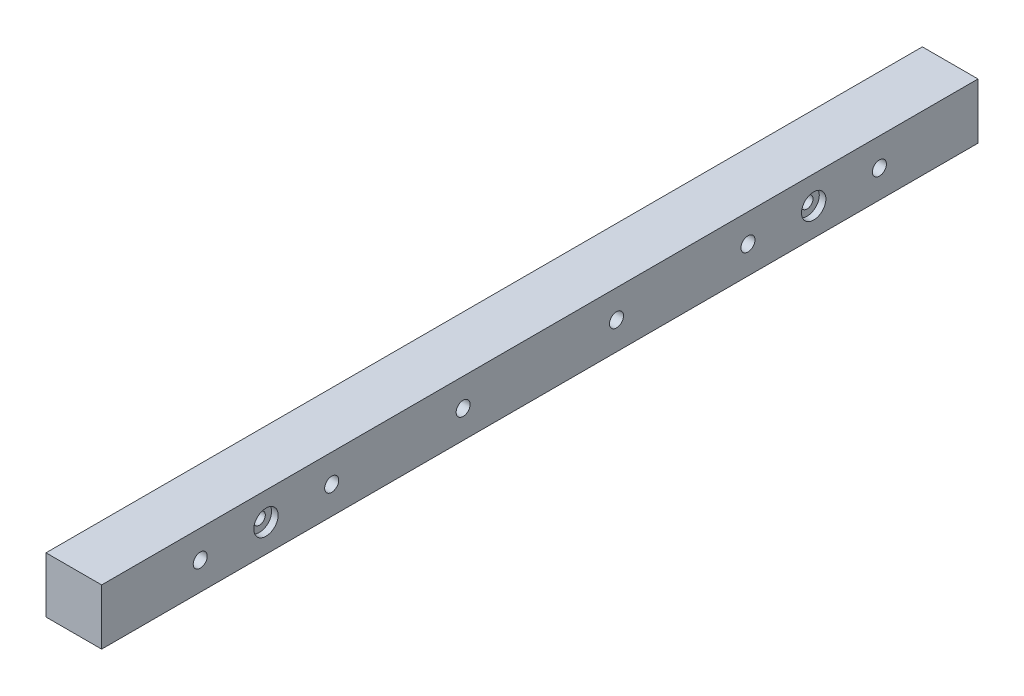
ISO-10303-21;
HEADER;
FILE_DESCRIPTION(('STEP AP214'),'2;1');
FILE_NAME('part.step','',(''),(''),'','','');
FILE_SCHEMA(('AUTOMOTIVE_DESIGN { 1 0 10303 214 1 1 1 1 }'));
ENDSEC;
DATA;
#1=APPLICATION_CONTEXT('core data for automotive mechanical design processes');
#2=APPLICATION_PROTOCOL_DEFINITION('international standard','automotive_design',2000,#1);
#3=PRODUCT_CONTEXT('',#1,'mechanical');
#4=PRODUCT('Part','Part','',(#3));
#5=PRODUCT_RELATED_PRODUCT_CATEGORY('part','',(#4));
#6=PRODUCT_DEFINITION_FORMATION('','',#4);
#7=PRODUCT_DEFINITION_CONTEXT('part definition',#1,'design');
#8=PRODUCT_DEFINITION('design','',#6,#7);
#9=PRODUCT_DEFINITION_SHAPE('','',#8);
#10=(LENGTH_UNIT() NAMED_UNIT(*) SI_UNIT(.MILLI.,.METRE.));
#11=(NAMED_UNIT(*) PLANE_ANGLE_UNIT() SI_UNIT($,.RADIAN.));
#12=(NAMED_UNIT(*) SI_UNIT($,.STERADIAN.) SOLID_ANGLE_UNIT());
#13=UNCERTAINTY_MEASURE_WITH_UNIT(LENGTH_MEASURE(1.E-05),#10,'distance_accuracy_value','');
#14=(GEOMETRIC_REPRESENTATION_CONTEXT(3) GLOBAL_UNCERTAINTY_ASSIGNED_CONTEXT((#13)) GLOBAL_UNIT_ASSIGNED_CONTEXT((#10,
#11,#12)) REPRESENTATION_CONTEXT('',''));
#15=CARTESIAN_POINT('',(0.,0.,0.));
#16=DIRECTION('',(0.,0.,1.));
#17=DIRECTION('',(1.,0.,0.));
#18=AXIS2_PLACEMENT_3D('',#15,#16,#17);
#19=CARTESIAN_POINT('',(12.7,-12.7,-200.));
#20=DIRECTION('',(1.,0.,0.));
#21=DIRECTION('',(0.,1.,0.));
#22=AXIS2_PLACEMENT_3D('',#19,#20,#21);
#23=PLANE('',#22);
#24=CARTESIAN_POINT('',(12.7,0.,-125.));
#25=DIRECTION('',(1.,0.,0.));
#26=DIRECTION('',(0.,0.,-1.));
#27=AXIS2_PLACEMENT_3D('',#24,#25,#26);
#28=CIRCLE('',#27,5.55625);
#29=CARTESIAN_POINT('',(12.7,0.,-130.55625));
#30=VERTEX_POINT('',#29);
#31=EDGE_CURVE('E195',#30,#30,#28,.T.);
#32=ORIENTED_EDGE('',*,*,#31,.F.);
#33=EDGE_LOOP('',(#32));
#34=FACE_BOUND('',#33,.T.);
#35=CARTESIAN_POINT('',(12.7,0.,-155.));
#36=DIRECTION('',(1.,0.,0.));
#37=DIRECTION('',(0.,1.,0.));
#38=AXIS2_PLACEMENT_3D('',#35,#36,#37);
#39=CIRCLE('',#38,3.20000000000001);
#40=CARTESIAN_POINT('',(12.7,3.19999999999998,-155.));
#41=VERTEX_POINT('',#40);
#42=EDGE_CURVE('E112',#41,#41,#39,.T.);
#43=ORIENTED_EDGE('',*,*,#42,.F.);
#44=EDGE_LOOP('',(#43));
#45=FACE_BOUND('',#44,.T.);
#46=CARTESIAN_POINT('',(12.7,0.,-95.));
#47=DIRECTION('',(1.,0.,0.));
#48=DIRECTION('',(0.,1.,0.));
#49=AXIS2_PLACEMENT_3D('',#46,#47,#48);
#50=CIRCLE('',#49,3.20000000000001);
#51=CARTESIAN_POINT('',(12.7,3.19999999999998,-95.));
#52=VERTEX_POINT('',#51);
#53=EDGE_CURVE('E163',#52,#52,#50,.T.);
#54=ORIENTED_EDGE('',*,*,#53,.F.);
#55=EDGE_LOOP('',(#54));
#56=FACE_BOUND('',#55,.T.);
#57=CARTESIAN_POINT('',(12.7,0.,-35.));
#58=DIRECTION('',(1.,0.,0.));
#59=DIRECTION('',(0.,1.,0.));
#60=AXIS2_PLACEMENT_3D('',#57,#58,#59);
#61=CIRCLE('',#60,3.20000000000001);
#62=CARTESIAN_POINT('',(12.7,3.19999999999998,-35.));
#63=VERTEX_POINT('',#62);
#64=EDGE_CURVE('E166',#63,#63,#61,.T.);
#65=ORIENTED_EDGE('',*,*,#64,.F.);
#66=EDGE_LOOP('',(#65));
#67=FACE_BOUND('',#66,.T.);
#68=CARTESIAN_POINT('',(12.7,0.,35.));
#69=DIRECTION('',(1.,0.,0.));
#70=DIRECTION('',(0.,1.,0.));
#71=AXIS2_PLACEMENT_3D('',#68,#69,#70);
#72=CIRCLE('',#71,3.20000000000001);
#73=CARTESIAN_POINT('',(12.7,3.19999999999998,35.));
#74=VERTEX_POINT('',#73);
#75=EDGE_CURVE('E169',#74,#74,#72,.T.);
#76=ORIENTED_EDGE('',*,*,#75,.F.);
#77=EDGE_LOOP('',(#76));
#78=FACE_BOUND('',#77,.T.);
#79=CARTESIAN_POINT('',(12.7,0.,95.));
#80=DIRECTION('',(1.,0.,0.));
#81=DIRECTION('',(0.,1.,0.));
#82=AXIS2_PLACEMENT_3D('',#79,#80,#81);
#83=CIRCLE('',#82,3.20000000000001);
#84=CARTESIAN_POINT('',(12.7,3.19999999999998,95.));
#85=VERTEX_POINT('',#84);
#86=EDGE_CURVE('E95',#85,#85,#83,.T.);
#87=ORIENTED_EDGE('',*,*,#86,.F.);
#88=EDGE_LOOP('',(#87));
#89=FACE_BOUND('',#88,.T.);
#90=CARTESIAN_POINT('',(12.7,0.,155.));
#91=DIRECTION('',(1.,0.,0.));
#92=DIRECTION('',(0.,1.,0.));
#93=AXIS2_PLACEMENT_3D('',#90,#91,#92);
#94=CIRCLE('',#93,3.20000000000001);
#95=CARTESIAN_POINT('',(12.7,3.19999999999998,155.));
#96=VERTEX_POINT('',#95);
#97=EDGE_CURVE('E92',#96,#96,#94,.T.);
#98=ORIENTED_EDGE('',*,*,#97,.F.);
#99=EDGE_LOOP('',(#98));
#100=FACE_BOUND('',#99,.T.);
#101=DIRECTION('',(0.,0.,1.));
#102=VECTOR('',#101,1.);
#103=CARTESIAN_POINT('',(12.7,12.7,-200.));
#104=LINE('',#103,#102);
#105=CARTESIAN_POINT('',(12.7,12.7,-200.));
#106=VERTEX_POINT('',#105);
#107=CARTESIAN_POINT('',(12.7,12.7,200.));
#108=VERTEX_POINT('',#107);
#109=EDGE_CURVE('E69',#106,#108,#104,.T.);
#110=ORIENTED_EDGE('',*,*,#109,.T.);
#111=DIRECTION('',(0.,1.,0.));
#112=VECTOR('',#111,1.);
#113=CARTESIAN_POINT('',(12.7,-12.7,200.));
#114=LINE('',#113,#112);
#115=CARTESIAN_POINT('',(12.7,-12.7,200.));
#116=VERTEX_POINT('',#115);
#117=EDGE_CURVE('E73',#116,#108,#114,.T.);
#118=ORIENTED_EDGE('',*,*,#117,.F.);
#119=DIRECTION('',(0.,0.,1.));
#120=VECTOR('',#119,1.);
#121=CARTESIAN_POINT('',(12.7,-12.7,-200.));
#122=LINE('',#121,#120);
#123=CARTESIAN_POINT('',(12.7,-12.7,-200.));
#124=VERTEX_POINT('',#123);
#125=EDGE_CURVE('E11',#124,#116,#122,.T.);
#126=ORIENTED_EDGE('',*,*,#125,.F.);
#127=DIRECTION('',(0.,1.,0.));
#128=VECTOR('',#127,1.);
#129=CARTESIAN_POINT('',(12.7,-12.7,-200.));
#130=LINE('',#129,#128);
#131=EDGE_CURVE('E74',#124,#106,#130,.T.);
#132=ORIENTED_EDGE('',*,*,#131,.T.);
#133=EDGE_LOOP('',(#110,#118,#126,#132));
#134=FACE_BOUND('',#133,.T.);
#135=CARTESIAN_POINT('',(12.7,0.,125.));
#136=DIRECTION('',(-1.,0.,0.));
#137=DIRECTION('',(0.,0.,1.));
#138=AXIS2_PLACEMENT_3D('',#135,#136,#137);
#139=CIRCLE('',#138,5.55625);
#140=CARTESIAN_POINT('',(12.7,0.,130.55625));
#141=VERTEX_POINT('',#140);
#142=EDGE_CURVE('E214',#141,#141,#139,.T.);
#143=ORIENTED_EDGE('',*,*,#142,.T.);
#144=EDGE_LOOP('',(#143));
#145=FACE_BOUND('',#144,.T.);
#146=ADVANCED_FACE('F31',(#34,#45,#56,#67,#78,#89,#100,#134,#145),#23,.T.);
#147=CARTESIAN_POINT('',(-12.7,-12.7,-200.));
#148=DIRECTION('',(-1.,0.,0.));
#149=DIRECTION('',(0.,-1.,0.));
#150=AXIS2_PLACEMENT_3D('',#147,#148,#149);
#151=PLANE('',#150);
#152=CARTESIAN_POINT('',(-12.7,0.,-125.));
#153=DIRECTION('',(1.,0.,0.));
#154=DIRECTION('',(0.,0.,-1.));
#155=AXIS2_PLACEMENT_3D('',#152,#153,#154);
#156=CIRCLE('',#155,6.00000000000001);
#157=CARTESIAN_POINT('',(-12.7,0.,-131.));
#158=VERTEX_POINT('',#157);
#159=EDGE_CURVE('E211',#158,#158,#156,.T.);
#160=ORIENTED_EDGE('',*,*,#159,.T.);
#161=EDGE_LOOP('',(#160));
#162=FACE_BOUND('',#161,.T.);
#163=CARTESIAN_POINT('',(-12.7,0.,155.));
#164=DIRECTION('',(-1.,0.,0.));
#165=DIRECTION('',(0.,-1.,0.));
#166=AXIS2_PLACEMENT_3D('',#163,#164,#165);
#167=CIRCLE('',#166,3.99999999999999);
#168=CARTESIAN_POINT('',(-12.7,-4.00000000000002,155.));
#169=VERTEX_POINT('',#168);
#170=EDGE_CURVE('E144',#169,#169,#167,.T.);
#171=ORIENTED_EDGE('',*,*,#170,.F.);
#172=EDGE_LOOP('',(#171));
#173=FACE_BOUND('',#172,.T.);
#174=CARTESIAN_POINT('',(-12.7,0.,95.));
#175=DIRECTION('',(-1.,0.,0.));
#176=DIRECTION('',(0.,-1.,0.));
#177=AXIS2_PLACEMENT_3D('',#174,#175,#176);
#178=CIRCLE('',#177,4.00000000000001);
#179=CARTESIAN_POINT('',(-12.7,-4.00000000000003,95.));
#180=VERTEX_POINT('',#179);
#181=EDGE_CURVE('E137',#180,#180,#178,.T.);
#182=ORIENTED_EDGE('',*,*,#181,.F.);
#183=EDGE_LOOP('',(#182));
#184=FACE_BOUND('',#183,.T.);
#185=CARTESIAN_POINT('',(-12.7,0.,35.));
#186=DIRECTION('',(-1.,0.,0.));
#187=DIRECTION('',(0.,-1.,0.));
#188=AXIS2_PLACEMENT_3D('',#185,#186,#187);
#189=CIRCLE('',#188,4.00000000000001);
#190=CARTESIAN_POINT('',(-12.7,-4.00000000000003,35.));
#191=VERTEX_POINT('',#190);
#192=EDGE_CURVE('E130',#191,#191,#189,.T.);
#193=ORIENTED_EDGE('',*,*,#192,.F.);
#194=EDGE_LOOP('',(#193));
#195=FACE_BOUND('',#194,.T.);
#196=CARTESIAN_POINT('',(-12.7,0.,-35.));
#197=DIRECTION('',(-1.,0.,0.));
#198=DIRECTION('',(0.,-1.,0.));
#199=AXIS2_PLACEMENT_3D('',#196,#197,#198);
#200=CIRCLE('',#199,4.);
#201=CARTESIAN_POINT('',(-12.7,-4.00000000000003,-35.));
#202=VERTEX_POINT('',#201);
#203=EDGE_CURVE('E126',#202,#202,#200,.T.);
#204=ORIENTED_EDGE('',*,*,#203,.F.);
#205=EDGE_LOOP('',(#204));
#206=FACE_BOUND('',#205,.T.);
#207=CARTESIAN_POINT('',(-12.7,0.,-95.));
#208=DIRECTION('',(-1.,0.,0.));
#209=DIRECTION('',(0.,-1.,0.));
#210=AXIS2_PLACEMENT_3D('',#207,#208,#209);
#211=CIRCLE('',#210,4.00000000000001);
#212=CARTESIAN_POINT('',(-12.7,-4.00000000000003,-95.));
#213=VERTEX_POINT('',#212);
#214=EDGE_CURVE('E122',#213,#213,#211,.T.);
#215=ORIENTED_EDGE('',*,*,#214,.F.);
#216=EDGE_LOOP('',(#215));
#217=FACE_BOUND('',#216,.T.);
#218=CARTESIAN_POINT('',(-12.7,0.,-155.));
#219=DIRECTION('',(-1.,0.,0.));
#220=DIRECTION('',(0.,-1.,0.));
#221=AXIS2_PLACEMENT_3D('',#218,#219,#220);
#222=CIRCLE('',#221,3.99999999999999);
#223=CARTESIAN_POINT('',(-12.7,-4.00000000000002,-155.));
#224=VERTEX_POINT('',#223);
#225=EDGE_CURVE('E117',#224,#224,#222,.T.);
#226=ORIENTED_EDGE('',*,*,#225,.F.);
#227=EDGE_LOOP('',(#226));
#228=FACE_BOUND('',#227,.T.);
#229=DIRECTION('',(0.,0.,1.));
#230=VECTOR('',#229,1.);
#231=CARTESIAN_POINT('',(-12.7,-12.7,-200.));
#232=LINE('',#231,#230);
#233=CARTESIAN_POINT('',(-12.7,-12.7,-200.));
#234=VERTEX_POINT('',#233);
#235=CARTESIAN_POINT('',(-12.7,-12.7,200.));
#236=VERTEX_POINT('',#235);
#237=EDGE_CURVE('E39',#234,#236,#232,.T.);
#238=ORIENTED_EDGE('',*,*,#237,.T.);
#239=DIRECTION('',(0.,-1.,0.));
#240=VECTOR('',#239,1.);
#241=CARTESIAN_POINT('',(-12.7,-12.7,200.));
#242=LINE('',#241,#240);
#243=CARTESIAN_POINT('',(-12.7,12.7,200.));
#244=VERTEX_POINT('',#243);
#245=EDGE_CURVE('E87',#244,#236,#242,.T.);
#246=ORIENTED_EDGE('',*,*,#245,.F.);
#247=DIRECTION('',(0.,0.,1.));
#248=VECTOR('',#247,1.);
#249=CARTESIAN_POINT('',(-12.7,12.7,-200.));
#250=LINE('',#249,#248);
#251=CARTESIAN_POINT('',(-12.7,12.7,-200.));
#252=VERTEX_POINT('',#251);
#253=EDGE_CURVE('E78',#252,#244,#250,.T.);
#254=ORIENTED_EDGE('',*,*,#253,.F.);
#255=DIRECTION('',(0.,-1.,0.));
#256=VECTOR('',#255,1.);
#257=CARTESIAN_POINT('',(-12.7,-12.7,-200.));
#258=LINE('',#257,#256);
#259=EDGE_CURVE('E104',#252,#234,#258,.T.);
#260=ORIENTED_EDGE('',*,*,#259,.T.);
#261=EDGE_LOOP('',(#238,#246,#254,#260));
#262=FACE_BOUND('',#261,.T.);
#263=CARTESIAN_POINT('',(-12.7,0.,125.));
#264=DIRECTION('',(-1.,0.,0.));
#265=DIRECTION('',(0.,0.,1.));
#266=AXIS2_PLACEMENT_3D('',#263,#264,#265);
#267=CIRCLE('',#266,6.00000000000001);
#268=CARTESIAN_POINT('',(-12.7,0.,131.));
#269=VERTEX_POINT('',#268);
#270=EDGE_CURVE('E229',#269,#269,#267,.T.);
#271=ORIENTED_EDGE('',*,*,#270,.F.);
#272=EDGE_LOOP('',(#271));
#273=FACE_BOUND('',#272,.T.);
#274=ADVANCED_FACE('F179',(#162,#173,#184,#195,#206,#217,#228,#262,#273),#151,.T.);
#275=CARTESIAN_POINT('',(-12.7,0.,155.));
#276=DIRECTION('',(1.,0.,0.));
#277=DIRECTION('',(0.,1.,0.));
#278=AXIS2_PLACEMENT_3D('',#275,#276,#277);
#279=CYLINDRICAL_SURFACE('',#278,3.20000000000001);
#280=ORIENTED_EDGE('',*,*,#97,.T.);
#281=EDGE_LOOP('',(#280));
#282=FACE_BOUND('',#281,.T.);
#283=CARTESIAN_POINT('',(-9.7,0.,155.));
#284=DIRECTION('',(-1.,0.,0.));
#285=DIRECTION('',(0.,-1.,0.));
#286=AXIS2_PLACEMENT_3D('',#283,#284,#285);
#287=CIRCLE('',#286,3.20000000000001);
#288=CARTESIAN_POINT('',(-9.7,-3.20000000000004,155.));
#289=VERTEX_POINT('',#288);
#290=EDGE_CURVE('E34',#289,#289,#287,.F.);
#291=ORIENTED_EDGE('',*,*,#290,.F.);
#292=EDGE_LOOP('',(#291));
#293=FACE_BOUND('',#292,.T.);
#294=ADVANCED_FACE('F183',(#282,#293),#279,.F.);
#295=CARTESIAN_POINT('',(-12.7,0.,95.));
#296=DIRECTION('',(1.,0.,0.));
#297=DIRECTION('',(0.,1.,0.));
#298=AXIS2_PLACEMENT_3D('',#295,#296,#297);
#299=CYLINDRICAL_SURFACE('',#298,3.20000000000001);
#300=ORIENTED_EDGE('',*,*,#86,.T.);
#301=EDGE_LOOP('',(#300));
#302=FACE_BOUND('',#301,.T.);
#303=CARTESIAN_POINT('',(-9.7,0.,95.));
#304=DIRECTION('',(-1.,0.,0.));
#305=DIRECTION('',(0.,-1.,0.));
#306=AXIS2_PLACEMENT_3D('',#303,#304,#305);
#307=CIRCLE('',#306,3.20000000000001);
#308=CARTESIAN_POINT('',(-9.7,-3.20000000000004,95.));
#309=VERTEX_POINT('',#308);
#310=EDGE_CURVE('E128',#309,#309,#307,.F.);
#311=ORIENTED_EDGE('',*,*,#310,.F.);
#312=EDGE_LOOP('',(#311));
#313=FACE_BOUND('',#312,.T.);
#314=ADVANCED_FACE('F174',(#302,#313),#299,.F.);
#315=CARTESIAN_POINT('',(-12.7,0.,35.));
#316=DIRECTION('',(1.,0.,0.));
#317=DIRECTION('',(0.,1.,0.));
#318=AXIS2_PLACEMENT_3D('',#315,#316,#317);
#319=CYLINDRICAL_SURFACE('',#318,3.20000000000001);
#320=ORIENTED_EDGE('',*,*,#75,.T.);
#321=EDGE_LOOP('',(#320));
#322=FACE_BOUND('',#321,.T.);
#323=CARTESIAN_POINT('',(-9.7,0.,35.));
#324=DIRECTION('',(-1.,0.,0.));
#325=DIRECTION('',(0.,-1.,0.));
#326=AXIS2_PLACEMENT_3D('',#323,#324,#325);
#327=CIRCLE('',#326,3.20000000000001);
#328=CARTESIAN_POINT('',(-9.7,-3.20000000000004,35.));
#329=VERTEX_POINT('',#328);
#330=EDGE_CURVE('E124',#329,#329,#327,.F.);
#331=ORIENTED_EDGE('',*,*,#330,.F.);
#332=EDGE_LOOP('',(#331));
#333=FACE_BOUND('',#332,.T.);
#334=ADVANCED_FACE('F274',(#322,#333),#319,.F.);
#335=CARTESIAN_POINT('',(-12.7,0.,-35.));
#336=DIRECTION('',(1.,0.,0.));
#337=DIRECTION('',(0.,1.,0.));
#338=AXIS2_PLACEMENT_3D('',#335,#336,#337);
#339=CYLINDRICAL_SURFACE('',#338,3.20000000000001);
#340=ORIENTED_EDGE('',*,*,#64,.T.);
#341=EDGE_LOOP('',(#340));
#342=FACE_BOUND('',#341,.T.);
#343=CARTESIAN_POINT('',(-9.7,0.,-35.));
#344=DIRECTION('',(-1.,0.,0.));
#345=DIRECTION('',(0.,-1.,0.));
#346=AXIS2_PLACEMENT_3D('',#343,#344,#345);
#347=CIRCLE('',#346,3.20000000000001);
#348=CARTESIAN_POINT('',(-9.7,-3.20000000000004,-35.));
#349=VERTEX_POINT('',#348);
#350=EDGE_CURVE('E119',#349,#349,#347,.F.);
#351=ORIENTED_EDGE('',*,*,#350,.F.);
#352=EDGE_LOOP('',(#351));
#353=FACE_BOUND('',#352,.T.);
#354=ADVANCED_FACE('F264',(#342,#353),#339,.F.);
#355=CARTESIAN_POINT('',(-12.7,0.,-95.));
#356=DIRECTION('',(1.,0.,0.));
#357=DIRECTION('',(0.,1.,0.));
#358=AXIS2_PLACEMENT_3D('',#355,#356,#357);
#359=CYLINDRICAL_SURFACE('',#358,3.20000000000001);
#360=ORIENTED_EDGE('',*,*,#53,.T.);
#361=EDGE_LOOP('',(#360));
#362=FACE_BOUND('',#361,.T.);
#363=CARTESIAN_POINT('',(-9.7,0.,-95.));
#364=DIRECTION('',(-1.,0.,0.));
#365=DIRECTION('',(0.,-1.,0.));
#366=AXIS2_PLACEMENT_3D('',#363,#364,#365);
#367=CIRCLE('',#366,3.20000000000001);
#368=CARTESIAN_POINT('',(-9.7,-3.20000000000004,-95.));
#369=VERTEX_POINT('',#368);
#370=EDGE_CURVE('E114',#369,#369,#367,.F.);
#371=ORIENTED_EDGE('',*,*,#370,.F.);
#372=EDGE_LOOP('',(#371));
#373=FACE_BOUND('',#372,.T.);
#374=ADVANCED_FACE('F255',(#362,#373),#359,.F.);
#375=CARTESIAN_POINT('',(-12.7,0.,-155.));
#376=DIRECTION('',(1.,0.,0.));
#377=DIRECTION('',(0.,1.,0.));
#378=AXIS2_PLACEMENT_3D('',#375,#376,#377);
#379=CYLINDRICAL_SURFACE('',#378,3.20000000000001);
#380=ORIENTED_EDGE('',*,*,#42,.T.);
#381=EDGE_LOOP('',(#380));
#382=FACE_BOUND('',#381,.T.);
#383=CARTESIAN_POINT('',(-9.7,0.,-155.));
#384=DIRECTION('',(-1.,0.,0.));
#385=DIRECTION('',(0.,-1.,0.));
#386=AXIS2_PLACEMENT_3D('',#383,#384,#385);
#387=CIRCLE('',#386,3.20000000000001);
#388=CARTESIAN_POINT('',(-9.7,-3.20000000000004,-155.));
#389=VERTEX_POINT('',#388);
#390=EDGE_CURVE('E109',#389,#389,#387,.F.);
#391=ORIENTED_EDGE('',*,*,#390,.F.);
#392=EDGE_LOOP('',(#391));
#393=FACE_BOUND('',#392,.T.);
#394=ADVANCED_FACE('F251',(#382,#393),#379,.F.);
#395=CARTESIAN_POINT('',(12.7,-12.7,-200.));
#396=DIRECTION('',(0.,-1.,0.));
#397=DIRECTION('',(0.,0.,-1.));
#398=AXIS2_PLACEMENT_3D('',#395,#396,#397);
#399=PLANE('',#398);
#400=ORIENTED_EDGE('',*,*,#125,.T.);
#401=DIRECTION('',(1.,0.,0.));
#402=VECTOR('',#401,1.);
#403=CARTESIAN_POINT('',(12.7,-12.7,200.));
#404=LINE('',#403,#402);
#405=EDGE_CURVE('E91',#236,#116,#404,.T.);
#406=ORIENTED_EDGE('',*,*,#405,.F.);
#407=ORIENTED_EDGE('',*,*,#237,.F.);
#408=DIRECTION('',(1.,0.,0.));
#409=VECTOR('',#408,1.);
#410=CARTESIAN_POINT('',(12.7,-12.7,-200.));
#411=LINE('',#410,#409);
#412=EDGE_CURVE('E79',#234,#124,#411,.T.);
#413=ORIENTED_EDGE('',*,*,#412,.T.);
#414=EDGE_LOOP('',(#400,#406,#407,#413));
#415=FACE_BOUND('',#414,.T.);
#416=ADVANCED_FACE('F242',(#415),#399,.T.);
#417=CARTESIAN_POINT('',(12.7,12.7,-200.));
#418=DIRECTION('',(0.,1.,0.));
#419=DIRECTION('',(0.,0.,1.));
#420=AXIS2_PLACEMENT_3D('',#417,#418,#419);
#421=PLANE('',#420);
#422=ORIENTED_EDGE('',*,*,#253,.T.);
#423=DIRECTION('',(-1.,0.,0.));
#424=VECTOR('',#423,1.);
#425=CARTESIAN_POINT('',(12.7,12.7,200.));
#426=LINE('',#425,#424);
#427=EDGE_CURVE('E82',#108,#244,#426,.T.);
#428=ORIENTED_EDGE('',*,*,#427,.F.);
#429=ORIENTED_EDGE('',*,*,#109,.F.);
#430=DIRECTION('',(-1.,0.,0.));
#431=VECTOR('',#430,1.);
#432=CARTESIAN_POINT('',(12.7,12.7,-200.));
#433=LINE('',#432,#431);
#434=EDGE_CURVE('E102',#106,#252,#433,.T.);
#435=ORIENTED_EDGE('',*,*,#434,.T.);
#436=EDGE_LOOP('',(#422,#428,#429,#435));
#437=FACE_BOUND('',#436,.T.);
#438=ADVANCED_FACE('F83',(#437),#421,.T.);
#439=CARTESIAN_POINT('',(12.7,12.7,-200.));
#440=DIRECTION('',(0.,0.,1.));
#441=DIRECTION('',(1.,0.,0.));
#442=AXIS2_PLACEMENT_3D('',#439,#440,#441);
#443=PLANE('',#442);
#444=ORIENTED_EDGE('',*,*,#131,.F.);
#445=ORIENTED_EDGE('',*,*,#412,.F.);
#446=ORIENTED_EDGE('',*,*,#259,.F.);
#447=ORIENTED_EDGE('',*,*,#434,.F.);
#448=EDGE_LOOP('',(#444,#445,#446,#447));
#449=FACE_BOUND('',#448,.T.);
#450=ADVANCED_FACE('F245',(#449),#443,.F.);
#451=CARTESIAN_POINT('',(12.7,12.7,200.));
#452=DIRECTION('',(0.,0.,1.));
#453=DIRECTION('',(1.,0.,0.));
#454=AXIS2_PLACEMENT_3D('',#451,#452,#453);
#455=PLANE('',#454);
#456=ORIENTED_EDGE('',*,*,#117,.T.);
#457=ORIENTED_EDGE('',*,*,#427,.T.);
#458=ORIENTED_EDGE('',*,*,#245,.T.);
#459=ORIENTED_EDGE('',*,*,#405,.T.);
#460=EDGE_LOOP('',(#456,#457,#458,#459));
#461=FACE_BOUND('',#460,.T.);
#462=ADVANCED_FACE('F90',(#461),#455,.T.);
#463=CARTESIAN_POINT('',(-9.7,0.,-155.));
#464=DIRECTION('',(-1.,0.,0.));
#465=DIRECTION('',(0.,-1.,0.));
#466=AXIS2_PLACEMENT_3D('',#463,#464,#465);
#467=PLANE('',#466);
#468=CARTESIAN_POINT('',(-9.7,0.,-155.));
#469=DIRECTION('',(-1.,0.,0.));
#470=DIRECTION('',(0.,-1.,0.));
#471=AXIS2_PLACEMENT_3D('',#468,#469,#470);
#472=CIRCLE('',#471,3.99999999999999);
#473=CARTESIAN_POINT('',(-9.7,-4.00000000000002,-155.));
#474=VERTEX_POINT('',#473);
#475=EDGE_CURVE('E113',#474,#474,#472,.T.);
#476=ORIENTED_EDGE('',*,*,#475,.T.);
#477=EDGE_LOOP('',(#476));
#478=FACE_BOUND('',#477,.T.);
#479=ORIENTED_EDGE('',*,*,#390,.T.);
#480=EDGE_LOOP('',(#479));
#481=FACE_BOUND('',#480,.T.);
#482=ADVANCED_FACE('F282',(#478,#481),#467,.T.);
#483=CARTESIAN_POINT('',(-9.7,0.,-155.));
#484=DIRECTION('',(-1.,0.,0.));
#485=DIRECTION('',(0.,-1.,0.));
#486=AXIS2_PLACEMENT_3D('',#483,#484,#485);
#487=CYLINDRICAL_SURFACE('',#486,3.99999999999999);
#488=ORIENTED_EDGE('',*,*,#475,.F.);
#489=EDGE_LOOP('',(#488));
#490=FACE_BOUND('',#489,.T.);
#491=ORIENTED_EDGE('',*,*,#225,.T.);
#492=EDGE_LOOP('',(#491));
#493=FACE_BOUND('',#492,.T.);
#494=ADVANCED_FACE('F269',(#490,#493),#487,.F.);
#495=CARTESIAN_POINT('',(-9.7,0.,-95.));
#496=DIRECTION('',(-1.,0.,0.));
#497=DIRECTION('',(0.,-1.,0.));
#498=AXIS2_PLACEMENT_3D('',#495,#496,#497);
#499=PLANE('',#498);
#500=CARTESIAN_POINT('',(-9.7,0.,-95.));
#501=DIRECTION('',(-1.,0.,0.));
#502=DIRECTION('',(0.,-1.,0.));
#503=AXIS2_PLACEMENT_3D('',#500,#501,#502);
#504=CIRCLE('',#503,4.00000000000001);
#505=CARTESIAN_POINT('',(-9.7,-4.00000000000003,-95.));
#506=VERTEX_POINT('',#505);
#507=EDGE_CURVE('E118',#506,#506,#504,.T.);
#508=ORIENTED_EDGE('',*,*,#507,.T.);
#509=EDGE_LOOP('',(#508));
#510=FACE_BOUND('',#509,.T.);
#511=ORIENTED_EDGE('',*,*,#370,.T.);
#512=EDGE_LOOP('',(#511));
#513=FACE_BOUND('',#512,.T.);
#514=ADVANCED_FACE('F290',(#510,#513),#499,.T.);
#515=CARTESIAN_POINT('',(-9.7,0.,-95.));
#516=DIRECTION('',(-1.,0.,0.));
#517=DIRECTION('',(0.,-1.,0.));
#518=AXIS2_PLACEMENT_3D('',#515,#516,#517);
#519=CYLINDRICAL_SURFACE('',#518,4.00000000000001);
#520=ORIENTED_EDGE('',*,*,#507,.F.);
#521=EDGE_LOOP('',(#520));
#522=FACE_BOUND('',#521,.T.);
#523=ORIENTED_EDGE('',*,*,#214,.T.);
#524=EDGE_LOOP('',(#523));
#525=FACE_BOUND('',#524,.T.);
#526=ADVANCED_FACE('F294',(#522,#525),#519,.F.);
#527=CARTESIAN_POINT('',(-9.7,0.,-35.));
#528=DIRECTION('',(-1.,0.,0.));
#529=DIRECTION('',(0.,-1.,0.));
#530=AXIS2_PLACEMENT_3D('',#527,#528,#529);
#531=PLANE('',#530);
#532=CARTESIAN_POINT('',(-9.7,0.,-35.));
#533=DIRECTION('',(-1.,0.,0.));
#534=DIRECTION('',(0.,-1.,0.));
#535=AXIS2_PLACEMENT_3D('',#532,#533,#534);
#536=CIRCLE('',#535,4.);
#537=CARTESIAN_POINT('',(-9.7,-4.00000000000003,-35.));
#538=VERTEX_POINT('',#537);
#539=EDGE_CURVE('E123',#538,#538,#536,.T.);
#540=ORIENTED_EDGE('',*,*,#539,.T.);
#541=EDGE_LOOP('',(#540));
#542=FACE_BOUND('',#541,.T.);
#543=ORIENTED_EDGE('',*,*,#350,.T.);
#544=EDGE_LOOP('',(#543));
#545=FACE_BOUND('',#544,.T.);
#546=ADVANCED_FACE('F297',(#542,#545),#531,.T.);
#547=CARTESIAN_POINT('',(-9.7,0.,-35.));
#548=DIRECTION('',(-1.,0.,0.));
#549=DIRECTION('',(0.,-1.,0.));
#550=AXIS2_PLACEMENT_3D('',#547,#548,#549);
#551=CYLINDRICAL_SURFACE('',#550,4.);
#552=ORIENTED_EDGE('',*,*,#539,.F.);
#553=EDGE_LOOP('',(#552));
#554=FACE_BOUND('',#553,.T.);
#555=ORIENTED_EDGE('',*,*,#203,.T.);
#556=EDGE_LOOP('',(#555));
#557=FACE_BOUND('',#556,.T.);
#558=ADVANCED_FACE('F302',(#554,#557),#551,.F.);
#559=CARTESIAN_POINT('',(-9.7,0.,35.));
#560=DIRECTION('',(-1.,0.,0.));
#561=DIRECTION('',(0.,-1.,0.));
#562=AXIS2_PLACEMENT_3D('',#559,#560,#561);
#563=PLANE('',#562);
#564=CARTESIAN_POINT('',(-9.7,0.,35.));
#565=DIRECTION('',(-1.,0.,0.));
#566=DIRECTION('',(0.,-1.,0.));
#567=AXIS2_PLACEMENT_3D('',#564,#565,#566);
#568=CIRCLE('',#567,4.00000000000001);
#569=CARTESIAN_POINT('',(-9.7,-4.00000000000003,35.));
#570=VERTEX_POINT('',#569);
#571=EDGE_CURVE('E127',#570,#570,#568,.T.);
#572=ORIENTED_EDGE('',*,*,#571,.T.);
#573=EDGE_LOOP('',(#572));
#574=FACE_BOUND('',#573,.T.);
#575=ORIENTED_EDGE('',*,*,#330,.T.);
#576=EDGE_LOOP('',(#575));
#577=FACE_BOUND('',#576,.T.);
#578=ADVANCED_FACE('F305',(#574,#577),#563,.T.);
#579=CARTESIAN_POINT('',(-9.7,0.,35.));
#580=DIRECTION('',(-1.,0.,0.));
#581=DIRECTION('',(0.,-1.,0.));
#582=AXIS2_PLACEMENT_3D('',#579,#580,#581);
#583=CYLINDRICAL_SURFACE('',#582,4.00000000000001);
#584=ORIENTED_EDGE('',*,*,#571,.F.);
#585=EDGE_LOOP('',(#584));
#586=FACE_BOUND('',#585,.T.);
#587=ORIENTED_EDGE('',*,*,#192,.T.);
#588=EDGE_LOOP('',(#587));
#589=FACE_BOUND('',#588,.T.);
#590=ADVANCED_FACE('F310',(#586,#589),#583,.F.);
#591=CARTESIAN_POINT('',(-9.7,0.,95.));
#592=DIRECTION('',(-1.,0.,0.));
#593=DIRECTION('',(0.,-1.,0.));
#594=AXIS2_PLACEMENT_3D('',#591,#592,#593);
#595=PLANE('',#594);
#596=CARTESIAN_POINT('',(-9.7,0.,95.));
#597=DIRECTION('',(-1.,0.,0.));
#598=DIRECTION('',(0.,-1.,0.));
#599=AXIS2_PLACEMENT_3D('',#596,#597,#598);
#600=CIRCLE('',#599,4.00000000000001);
#601=CARTESIAN_POINT('',(-9.7,-4.00000000000003,95.));
#602=VERTEX_POINT('',#601);
#603=EDGE_CURVE('E131',#602,#602,#600,.T.);
#604=ORIENTED_EDGE('',*,*,#603,.T.);
#605=EDGE_LOOP('',(#604));
#606=FACE_BOUND('',#605,.T.);
#607=ORIENTED_EDGE('',*,*,#310,.T.);
#608=EDGE_LOOP('',(#607));
#609=FACE_BOUND('',#608,.T.);
#610=ADVANCED_FACE('F313',(#606,#609),#595,.T.);
#611=CARTESIAN_POINT('',(-9.7,0.,95.));
#612=DIRECTION('',(-1.,0.,0.));
#613=DIRECTION('',(0.,-1.,0.));
#614=AXIS2_PLACEMENT_3D('',#611,#612,#613);
#615=CYLINDRICAL_SURFACE('',#614,4.00000000000001);
#616=ORIENTED_EDGE('',*,*,#603,.F.);
#617=EDGE_LOOP('',(#616));
#618=FACE_BOUND('',#617,.T.);
#619=ORIENTED_EDGE('',*,*,#181,.T.);
#620=EDGE_LOOP('',(#619));
#621=FACE_BOUND('',#620,.T.);
#622=ADVANCED_FACE('F318',(#618,#621),#615,.F.);
#623=CARTESIAN_POINT('',(-9.7,0.,155.));
#624=DIRECTION('',(-1.,0.,0.));
#625=DIRECTION('',(0.,-1.,0.));
#626=AXIS2_PLACEMENT_3D('',#623,#624,#625);
#627=PLANE('',#626);
#628=CARTESIAN_POINT('',(-9.7,0.,155.));
#629=DIRECTION('',(-1.,0.,0.));
#630=DIRECTION('',(0.,-1.,0.));
#631=AXIS2_PLACEMENT_3D('',#628,#629,#630);
#632=CIRCLE('',#631,3.99999999999999);
#633=CARTESIAN_POINT('',(-9.7,-4.00000000000002,155.));
#634=VERTEX_POINT('',#633);
#635=EDGE_CURVE('E190',#634,#634,#632,.T.);
#636=ORIENTED_EDGE('',*,*,#635,.T.);
#637=EDGE_LOOP('',(#636));
#638=FACE_BOUND('',#637,.T.);
#639=ORIENTED_EDGE('',*,*,#290,.T.);
#640=EDGE_LOOP('',(#639));
#641=FACE_BOUND('',#640,.T.);
#642=ADVANCED_FACE('F321',(#638,#641),#627,.T.);
#643=CARTESIAN_POINT('',(-9.7,0.,155.));
#644=DIRECTION('',(-1.,0.,0.));
#645=DIRECTION('',(0.,-1.,0.));
#646=AXIS2_PLACEMENT_3D('',#643,#644,#645);
#647=CYLINDRICAL_SURFACE('',#646,3.99999999999999);
#648=ORIENTED_EDGE('',*,*,#635,.F.);
#649=EDGE_LOOP('',(#648));
#650=FACE_BOUND('',#649,.T.);
#651=ORIENTED_EDGE('',*,*,#170,.T.);
#652=EDGE_LOOP('',(#651));
#653=FACE_BOUND('',#652,.T.);
#654=ADVANCED_FACE('F325',(#650,#653),#647,.F.);
#655=CARTESIAN_POINT('',(12.7,0.,-125.));
#656=DIRECTION('',(1.,0.,0.));
#657=DIRECTION('',(0.,0.,-1.));
#658=AXIS2_PLACEMENT_3D('',#655,#656,#657);
#659=CYLINDRICAL_SURFACE('',#658,5.55625);
#660=ORIENTED_EDGE('',*,*,#31,.T.);
#661=EDGE_LOOP('',(#660));
#662=FACE_BOUND('',#661,.T.);
#663=CARTESIAN_POINT('',(9.69999999999998,0.,-125.));
#664=DIRECTION('',(1.,0.,0.));
#665=DIRECTION('',(0.,0.,-1.));
#666=AXIS2_PLACEMENT_3D('',#663,#664,#665);
#667=CIRCLE('',#666,5.55625);
#668=CARTESIAN_POINT('',(9.69999999999998,0.,-130.55625));
#669=VERTEX_POINT('',#668);
#670=EDGE_CURVE('E199',#669,#669,#667,.T.);
#671=ORIENTED_EDGE('',*,*,#670,.F.);
#672=EDGE_LOOP('',(#671));
#673=FACE_BOUND('',#672,.T.);
#674=ADVANCED_FACE('F328',(#662,#673),#659,.F.);
#675=CARTESIAN_POINT('',(9.69999999999998,0.,-119.44375));
#676=DIRECTION('',(1.,0.,0.));
#677=DIRECTION('',(0.,0.,-1.));
#678=AXIS2_PLACEMENT_3D('',#675,#676,#677);
#679=PLANE('',#678);
#680=ORIENTED_EDGE('',*,*,#670,.T.);
#681=EDGE_LOOP('',(#680));
#682=FACE_BOUND('',#681,.T.);
#683=CARTESIAN_POINT('',(9.69999999999998,0.,-125.));
#684=DIRECTION('',(1.,0.,0.));
#685=DIRECTION('',(0.,0.,-1.));
#686=AXIS2_PLACEMENT_3D('',#683,#684,#685);
#687=CIRCLE('',#686,2.69999999999999);
#688=CARTESIAN_POINT('',(9.69999999999998,0.,-127.7));
#689=VERTEX_POINT('',#688);
#690=EDGE_CURVE('E202',#689,#689,#687,.T.);
#691=ORIENTED_EDGE('',*,*,#690,.F.);
#692=EDGE_LOOP('',(#691));
#693=FACE_BOUND('',#692,.T.);
#694=ADVANCED_FACE('F334',(#682,#693),#679,.T.);
#695=CARTESIAN_POINT('',(12.7,0.,-125.));
#696=DIRECTION('',(1.,0.,0.));
#697=DIRECTION('',(0.,0.,-1.));
#698=AXIS2_PLACEMENT_3D('',#695,#696,#697);
#699=CYLINDRICAL_SURFACE('',#698,2.69999999999999);
#700=ORIENTED_EDGE('',*,*,#690,.T.);
#701=EDGE_LOOP('',(#700));
#702=FACE_BOUND('',#701,.T.);
#703=CARTESIAN_POINT('',(4.20525588832576,0.,-125.));
#704=DIRECTION('',(1.,0.,0.));
#705=DIRECTION('',(0.,0.,-1.));
#706=AXIS2_PLACEMENT_3D('',#703,#704,#705);
#707=CIRCLE('',#706,2.69999999999999);
#708=CARTESIAN_POINT('',(4.20525588832576,0.,-127.7));
#709=VERTEX_POINT('',#708);
#710=EDGE_CURVE('E205',#709,#709,#707,.T.);
#711=ORIENTED_EDGE('',*,*,#710,.F.);
#712=EDGE_LOOP('',(#711));
#713=FACE_BOUND('',#712,.T.);
#714=ADVANCED_FACE('F338',(#702,#713),#699,.F.);
#715=CARTESIAN_POINT('',(2.3,0.,-125.));
#716=DIRECTION('',(-1.,0.,0.));
#717=DIRECTION('',(0.,0.,1.));
#718=AXIS2_PLACEMENT_3D('',#715,#716,#717);
#719=CONICAL_SURFACE('',#718,6.00000000000001,1.0471975511966);
#720=ORIENTED_EDGE('',*,*,#710,.T.);
#721=EDGE_LOOP('',(#720));
#722=FACE_BOUND('',#721,.T.);
#723=CARTESIAN_POINT('',(2.3,0.,-125.));
#724=DIRECTION('',(1.,0.,0.));
#725=DIRECTION('',(0.,0.,-1.));
#726=AXIS2_PLACEMENT_3D('',#723,#724,#725);
#727=CIRCLE('',#726,6.00000000000001);
#728=CARTESIAN_POINT('',(2.3,0.,-131.));
#729=VERTEX_POINT('',#728);
#730=EDGE_CURVE('E208',#729,#729,#727,.T.);
#731=ORIENTED_EDGE('',*,*,#730,.F.);
#732=EDGE_LOOP('',(#731));
#733=FACE_BOUND('',#732,.T.);
#734=ADVANCED_FACE('F342',(#722,#733),#719,.F.);
#735=CARTESIAN_POINT('',(12.7,0.,-125.));
#736=DIRECTION('',(1.,0.,0.));
#737=DIRECTION('',(0.,0.,-1.));
#738=AXIS2_PLACEMENT_3D('',#735,#736,#737);
#739=CYLINDRICAL_SURFACE('',#738,6.00000000000001);
#740=ORIENTED_EDGE('',*,*,#730,.T.);
#741=EDGE_LOOP('',(#740));
#742=FACE_BOUND('',#741,.T.);
#743=ORIENTED_EDGE('',*,*,#159,.F.);
#744=EDGE_LOOP('',(#743));
#745=FACE_BOUND('',#744,.T.);
#746=ADVANCED_FACE('F346',(#742,#745),#739,.F.);
#747=CARTESIAN_POINT('',(12.7,0.,125.));
#748=DIRECTION('',(1.,0.,0.));
#749=DIRECTION('',(0.,0.,1.));
#750=AXIS2_PLACEMENT_3D('',#747,#748,#749);
#751=CYLINDRICAL_SURFACE('',#750,5.55625);
#752=ORIENTED_EDGE('',*,*,#142,.F.);
#753=EDGE_LOOP('',(#752));
#754=FACE_BOUND('',#753,.T.);
#755=CARTESIAN_POINT('',(9.69999999999998,0.,125.));
#756=DIRECTION('',(-1.,0.,0.));
#757=DIRECTION('',(0.,0.,1.));
#758=AXIS2_PLACEMENT_3D('',#755,#756,#757);
#759=CIRCLE('',#758,5.55625);
#760=CARTESIAN_POINT('',(9.69999999999998,0.,130.55625));
#761=VERTEX_POINT('',#760);
#762=EDGE_CURVE('E217',#761,#761,#759,.T.);
#763=ORIENTED_EDGE('',*,*,#762,.T.);
#764=EDGE_LOOP('',(#763));
#765=FACE_BOUND('',#764,.T.);
#766=ADVANCED_FACE('F350',(#754,#765),#751,.F.);
#767=CARTESIAN_POINT('',(9.69999999999998,0.,119.44375));
#768=DIRECTION('',(1.,0.,0.));
#769=DIRECTION('',(0.,0.,1.));
#770=AXIS2_PLACEMENT_3D('',#767,#768,#769);
#771=PLANE('',#770);
#772=ORIENTED_EDGE('',*,*,#762,.F.);
#773=EDGE_LOOP('',(#772));
#774=FACE_BOUND('',#773,.T.);
#775=CARTESIAN_POINT('',(9.69999999999998,0.,125.));
#776=DIRECTION('',(-1.,0.,0.));
#777=DIRECTION('',(0.,0.,1.));
#778=AXIS2_PLACEMENT_3D('',#775,#776,#777);
#779=CIRCLE('',#778,2.69999999999999);
#780=CARTESIAN_POINT('',(9.69999999999998,0.,127.7));
#781=VERTEX_POINT('',#780);
#782=EDGE_CURVE('E220',#781,#781,#779,.T.);
#783=ORIENTED_EDGE('',*,*,#782,.T.);
#784=EDGE_LOOP('',(#783));
#785=FACE_BOUND('',#784,.T.);
#786=ADVANCED_FACE('F354',(#774,#785),#771,.T.);
#787=CARTESIAN_POINT('',(12.7,0.,125.));
#788=DIRECTION('',(1.,0.,0.));
#789=DIRECTION('',(0.,0.,1.));
#790=AXIS2_PLACEMENT_3D('',#787,#788,#789);
#791=CYLINDRICAL_SURFACE('',#790,2.69999999999999);
#792=ORIENTED_EDGE('',*,*,#782,.F.);
#793=EDGE_LOOP('',(#792));
#794=FACE_BOUND('',#793,.T.);
#795=CARTESIAN_POINT('',(4.20525588832576,0.,125.));
#796=DIRECTION('',(-1.,0.,0.));
#797=DIRECTION('',(0.,0.,1.));
#798=AXIS2_PLACEMENT_3D('',#795,#796,#797);
#799=CIRCLE('',#798,2.69999999999999);
#800=CARTESIAN_POINT('',(4.20525588832576,0.,127.7));
#801=VERTEX_POINT('',#800);
#802=EDGE_CURVE('E223',#801,#801,#799,.T.);
#803=ORIENTED_EDGE('',*,*,#802,.T.);
#804=EDGE_LOOP('',(#803));
#805=FACE_BOUND('',#804,.T.);
#806=ADVANCED_FACE('F358',(#794,#805),#791,.F.);
#807=CARTESIAN_POINT('',(2.3,0.,125.));
#808=DIRECTION('',(-1.,0.,0.));
#809=DIRECTION('',(0.,0.,-1.));
#810=AXIS2_PLACEMENT_3D('',#807,#808,#809);
#811=CONICAL_SURFACE('',#810,6.00000000000001,1.0471975511966);
#812=ORIENTED_EDGE('',*,*,#802,.F.);
#813=EDGE_LOOP('',(#812));
#814=FACE_BOUND('',#813,.T.);
#815=CARTESIAN_POINT('',(2.3,0.,125.));
#816=DIRECTION('',(-1.,0.,0.));
#817=DIRECTION('',(0.,0.,1.));
#818=AXIS2_PLACEMENT_3D('',#815,#816,#817);
#819=CIRCLE('',#818,6.00000000000001);
#820=CARTESIAN_POINT('',(2.3,0.,131.));
#821=VERTEX_POINT('',#820);
#822=EDGE_CURVE('E226',#821,#821,#819,.T.);
#823=ORIENTED_EDGE('',*,*,#822,.T.);
#824=EDGE_LOOP('',(#823));
#825=FACE_BOUND('',#824,.T.);
#826=ADVANCED_FACE('F362',(#814,#825),#811,.F.);
#827=CARTESIAN_POINT('',(12.7,0.,125.));
#828=DIRECTION('',(1.,0.,0.));
#829=DIRECTION('',(0.,0.,1.));
#830=AXIS2_PLACEMENT_3D('',#827,#828,#829);
#831=CYLINDRICAL_SURFACE('',#830,6.00000000000001);
#832=ORIENTED_EDGE('',*,*,#822,.F.);
#833=EDGE_LOOP('',(#832));
#834=FACE_BOUND('',#833,.T.);
#835=ORIENTED_EDGE('',*,*,#270,.T.);
#836=EDGE_LOOP('',(#835));
#837=FACE_BOUND('',#836,.T.);
#838=ADVANCED_FACE('F233',(#834,#837),#831,.F.);
#839=CLOSED_SHELL('',(#146,#274,#294,#314,#334,#354,#374,#394,#416,#438,#450,#462,#482,#494,
#514,#526,#546,#558,#578,#590,#610,#622,#642,#654,#674,#694,#714,#734,#746,#766,#786,#806,#826,#838));
#840=MANIFOLD_SOLID_BREP('B2',#839);
#841=ADVANCED_BREP_SHAPE_REPRESENTATION('',(#18,#840),#14);
#842=SHAPE_DEFINITION_REPRESENTATION(#9,#841);
ENDSEC;
END-ISO-10303-21;
